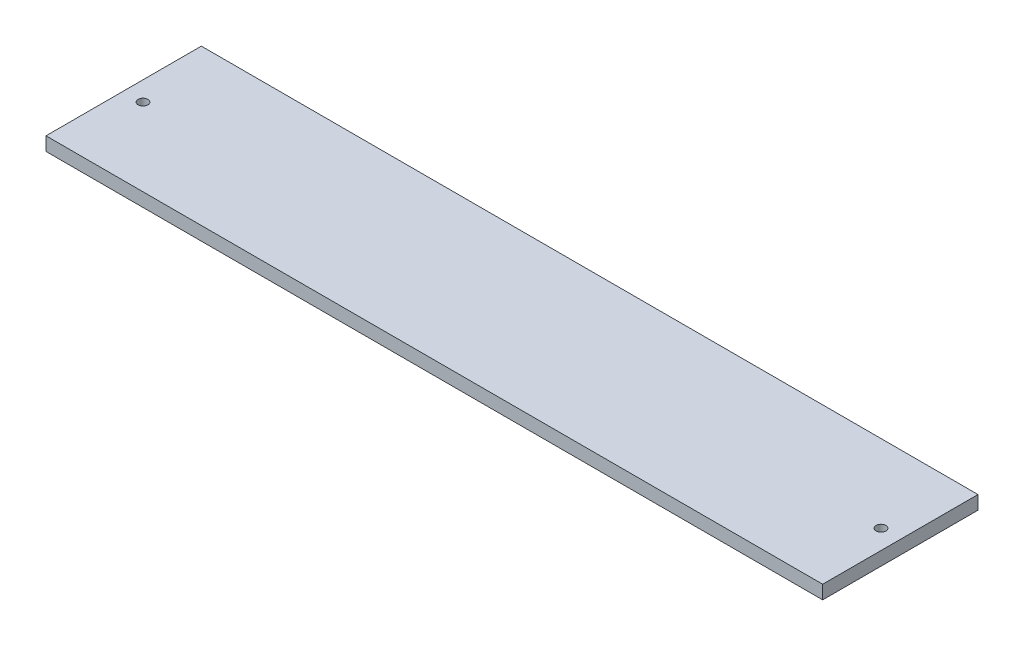
ISO-10303-21;
HEADER;
FILE_DESCRIPTION(('STEP AP214'),'2;1');
FILE_NAME('part.step','',(''),(''),'','','');
FILE_SCHEMA(('AUTOMOTIVE_DESIGN { 1 0 10303 214 1 1 1 1 }'));
ENDSEC;
DATA;
#1=APPLICATION_CONTEXT('core data for automotive mechanical design processes');
#2=APPLICATION_PROTOCOL_DEFINITION('international standard','automotive_design',2000,#1);
#3=PRODUCT_CONTEXT('',#1,'mechanical');
#4=PRODUCT('Part','Part','',(#3));
#5=PRODUCT_RELATED_PRODUCT_CATEGORY('part','',(#4));
#6=PRODUCT_DEFINITION_FORMATION('','',#4);
#7=PRODUCT_DEFINITION_CONTEXT('part definition',#1,'design');
#8=PRODUCT_DEFINITION('design','',#6,#7);
#9=PRODUCT_DEFINITION_SHAPE('','',#8);
#10=(LENGTH_UNIT() NAMED_UNIT(*) SI_UNIT(.MILLI.,.METRE.));
#11=(NAMED_UNIT(*) PLANE_ANGLE_UNIT() SI_UNIT($,.RADIAN.));
#12=(NAMED_UNIT(*) SI_UNIT($,.STERADIAN.) SOLID_ANGLE_UNIT());
#13=UNCERTAINTY_MEASURE_WITH_UNIT(LENGTH_MEASURE(1.E-05),#10,'distance_accuracy_value','');
#14=(GEOMETRIC_REPRESENTATION_CONTEXT(3) GLOBAL_UNCERTAINTY_ASSIGNED_CONTEXT((#13)) GLOBAL_UNIT_ASSIGNED_CONTEXT((#10,
#11,#12)) REPRESENTATION_CONTEXT('',''));
#15=CARTESIAN_POINT('',(0.,0.,0.));
#16=DIRECTION('',(0.,0.,1.));
#17=DIRECTION('',(1.,0.,0.));
#18=AXIS2_PLACEMENT_3D('',#15,#16,#17);
#19=CARTESIAN_POINT('',(0.,7.,0.));
#20=DIRECTION('',(1.,0.,0.));
#21=DIRECTION('',(0.,0.,-1.));
#22=AXIS2_PLACEMENT_3D('',#19,#20,#21);
#23=PLANE('',#22);
#24=DIRECTION('',(0.,0.,1.));
#25=VECTOR('',#24,1.);
#26=CARTESIAN_POINT('',(0.,0.,0.));
#27=LINE('',#26,#25);
#28=CARTESIAN_POINT('',(0.,0.,-80.));
#29=VERTEX_POINT('',#28);
#30=CARTESIAN_POINT('',(0.,0.,0.));
#31=VERTEX_POINT('',#30);
#32=EDGE_CURVE('E95',#29,#31,#27,.T.);
#33=ORIENTED_EDGE('',*,*,#32,.T.);
#34=DIRECTION('',(0.,-1.,0.));
#35=VECTOR('',#34,1.);
#36=CARTESIAN_POINT('',(0.,7.,0.));
#37=LINE('',#36,#35);
#38=CARTESIAN_POINT('',(0.,7.,0.));
#39=VERTEX_POINT('',#38);
#40=EDGE_CURVE('E11',#39,#31,#37,.T.);
#41=ORIENTED_EDGE('',*,*,#40,.F.);
#42=DIRECTION('',(0.,0.,1.));
#43=VECTOR('',#42,1.);
#44=CARTESIAN_POINT('',(0.,7.,0.));
#45=LINE('',#44,#43);
#46=CARTESIAN_POINT('',(0.,7.,-80.));
#47=VERTEX_POINT('',#46);
#48=EDGE_CURVE('E83',#47,#39,#45,.T.);
#49=ORIENTED_EDGE('',*,*,#48,.F.);
#50=DIRECTION('',(0.,-1.,0.));
#51=VECTOR('',#50,1.);
#52=CARTESIAN_POINT('',(0.,7.,-80.));
#53=LINE('',#52,#51);
#54=EDGE_CURVE('E91',#47,#29,#53,.T.);
#55=ORIENTED_EDGE('',*,*,#54,.T.);
#56=EDGE_LOOP('',(#33,#41,#49,#55));
#57=FACE_BOUND('',#56,.T.);
#58=ADVANCED_FACE('F32',(#57),#23,.F.);
#59=CARTESIAN_POINT('',(0.,7.,0.));
#60=DIRECTION('',(0.,0.,-1.));
#61=DIRECTION('',(-1.,0.,0.));
#62=AXIS2_PLACEMENT_3D('',#59,#60,#61);
#63=PLANE('',#62);
#64=DIRECTION('',(1.,0.,0.));
#65=VECTOR('',#64,1.);
#66=CARTESIAN_POINT('',(0.,0.,0.));
#67=LINE('',#66,#65);
#68=CARTESIAN_POINT('',(400.,0.,0.));
#69=VERTEX_POINT('',#68);
#70=EDGE_CURVE('E87',#31,#69,#67,.T.);
#71=ORIENTED_EDGE('',*,*,#70,.T.);
#72=DIRECTION('',(0.,-1.,0.));
#73=VECTOR('',#72,1.);
#74=CARTESIAN_POINT('',(400.,7.,0.));
#75=LINE('',#74,#73);
#76=CARTESIAN_POINT('',(400.,7.,0.));
#77=VERTEX_POINT('',#76);
#78=EDGE_CURVE('E40',#77,#69,#75,.T.);
#79=ORIENTED_EDGE('',*,*,#78,.F.);
#80=DIRECTION('',(1.,0.,0.));
#81=VECTOR('',#80,1.);
#82=CARTESIAN_POINT('',(0.,7.,0.));
#83=LINE('',#82,#81);
#84=EDGE_CURVE('E78',#39,#77,#83,.T.);
#85=ORIENTED_EDGE('',*,*,#84,.F.);
#86=ORIENTED_EDGE('',*,*,#40,.T.);
#87=EDGE_LOOP('',(#71,#79,#85,#86));
#88=FACE_BOUND('',#87,.T.);
#89=ADVANCED_FACE('F86',(#88),#63,.F.);
#90=CARTESIAN_POINT('',(400.,7.,0.));
#91=DIRECTION('',(-1.,0.,0.));
#92=DIRECTION('',(0.,0.,1.));
#93=AXIS2_PLACEMENT_3D('',#90,#91,#92);
#94=PLANE('',#93);
#95=DIRECTION('',(0.,0.,-1.));
#96=VECTOR('',#95,1.);
#97=CARTESIAN_POINT('',(400.,0.,0.));
#98=LINE('',#97,#96);
#99=CARTESIAN_POINT('',(400.,0.,-80.));
#100=VERTEX_POINT('',#99);
#101=EDGE_CURVE('E65',#69,#100,#98,.T.);
#102=ORIENTED_EDGE('',*,*,#101,.T.);
#103=DIRECTION('',(0.,-1.,0.));
#104=VECTOR('',#103,1.);
#105=CARTESIAN_POINT('',(400.,7.,-80.));
#106=LINE('',#105,#104);
#107=CARTESIAN_POINT('',(400.,7.,-80.));
#108=VERTEX_POINT('',#107);
#109=EDGE_CURVE('E88',#108,#100,#106,.T.);
#110=ORIENTED_EDGE('',*,*,#109,.F.);
#111=DIRECTION('',(0.,0.,-1.));
#112=VECTOR('',#111,1.);
#113=CARTESIAN_POINT('',(400.,7.,0.));
#114=LINE('',#113,#112);
#115=EDGE_CURVE('E81',#77,#108,#114,.T.);
#116=ORIENTED_EDGE('',*,*,#115,.F.);
#117=ORIENTED_EDGE('',*,*,#78,.T.);
#118=EDGE_LOOP('',(#102,#110,#116,#117));
#119=FACE_BOUND('',#118,.T.);
#120=ADVANCED_FACE('F89',(#119),#94,.F.);
#121=CARTESIAN_POINT('',(0.,7.,-80.));
#122=DIRECTION('',(0.,0.,1.));
#123=DIRECTION('',(1.,0.,0.));
#124=AXIS2_PLACEMENT_3D('',#121,#122,#123);
#125=PLANE('',#124);
#126=DIRECTION('',(-1.,0.,0.));
#127=VECTOR('',#126,1.);
#128=CARTESIAN_POINT('',(0.,0.,-80.));
#129=LINE('',#128,#127);
#130=EDGE_CURVE('E71',#100,#29,#129,.T.);
#131=ORIENTED_EDGE('',*,*,#130,.T.);
#132=ORIENTED_EDGE('',*,*,#54,.F.);
#133=DIRECTION('',(-1.,0.,0.));
#134=VECTOR('',#133,1.);
#135=CARTESIAN_POINT('',(0.,7.,-80.));
#136=LINE('',#135,#134);
#137=EDGE_CURVE('E48',#108,#47,#136,.T.);
#138=ORIENTED_EDGE('',*,*,#137,.F.);
#139=ORIENTED_EDGE('',*,*,#109,.T.);
#140=EDGE_LOOP('',(#131,#132,#138,#139));
#141=FACE_BOUND('',#140,.T.);
#142=ADVANCED_FACE('F103',(#141),#125,.F.);
#143=CARTESIAN_POINT('',(0.,7.,0.));
#144=DIRECTION('',(0.,-1.,0.));
#145=DIRECTION('',(0.,0.,-1.));
#146=AXIS2_PLACEMENT_3D('',#143,#144,#145);
#147=PLANE('',#146);
#148=CARTESIAN_POINT('',(9.95508986051211,7.,-39.9999999998883));
#149=DIRECTION('',(0.,-1.,0.));
#150=DIRECTION('',(0.,0.,-1.));
#151=AXIS2_PLACEMENT_3D('',#148,#149,#150);
#152=CIRCLE('',#151,2.50000000000002);
#153=CARTESIAN_POINT('',(9.95508986051211,7.,-42.4999999998883));
#154=VERTEX_POINT('',#153);
#155=EDGE_CURVE('E98',#154,#154,#152,.T.);
#156=ORIENTED_EDGE('',*,*,#155,.T.);
#157=EDGE_LOOP('',(#156));
#158=FACE_BOUND('',#157,.T.);
#159=CARTESIAN_POINT('',(390.044910139488,7.,-39.9999999998883));
#160=DIRECTION('',(0.,-1.,0.));
#161=DIRECTION('',(0.,0.,-1.));
#162=AXIS2_PLACEMENT_3D('',#159,#160,#161);
#163=CIRCLE('',#162,2.50000000000002);
#164=CARTESIAN_POINT('',(390.044910139488,7.,-42.4999999998883));
#165=VERTEX_POINT('',#164);
#166=EDGE_CURVE('E111',#165,#165,#163,.T.);
#167=ORIENTED_EDGE('',*,*,#166,.T.);
#168=EDGE_LOOP('',(#167));
#169=FACE_BOUND('',#168,.T.);
#170=ORIENTED_EDGE('',*,*,#48,.T.);
#171=ORIENTED_EDGE('',*,*,#84,.T.);
#172=ORIENTED_EDGE('',*,*,#115,.T.);
#173=ORIENTED_EDGE('',*,*,#137,.T.);
#174=EDGE_LOOP('',(#170,#171,#172,#173));
#175=FACE_BOUND('',#174,.T.);
#176=ADVANCED_FACE('F79',(#158,#169,#175),#147,.F.);
#177=CARTESIAN_POINT('',(0.,0.,0.));
#178=DIRECTION('',(0.,-1.,0.));
#179=DIRECTION('',(0.,0.,-1.));
#180=AXIS2_PLACEMENT_3D('',#177,#178,#179);
#181=PLANE('',#180);
#182=CARTESIAN_POINT('',(9.95508986051211,0.,-39.9999999998883));
#183=DIRECTION('',(0.,-1.,0.));
#184=DIRECTION('',(0.,0.,-1.));
#185=AXIS2_PLACEMENT_3D('',#182,#183,#184);
#186=CIRCLE('',#185,2.50000000000002);
#187=CARTESIAN_POINT('',(9.95508986051211,0.,-42.4999999998883));
#188=VERTEX_POINT('',#187);
#189=EDGE_CURVE('E114',#188,#188,#186,.T.);
#190=ORIENTED_EDGE('',*,*,#189,.F.);
#191=EDGE_LOOP('',(#190));
#192=FACE_BOUND('',#191,.T.);
#193=CARTESIAN_POINT('',(390.044910139488,0.,-39.9999999998883));
#194=DIRECTION('',(0.,-1.,0.));
#195=DIRECTION('',(0.,0.,1.));
#196=AXIS2_PLACEMENT_3D('',#193,#194,#195);
#197=CIRCLE('',#196,2.50000000000002);
#198=CARTESIAN_POINT('',(390.044910139488,0.,-37.4999999998883));
#199=VERTEX_POINT('',#198);
#200=EDGE_CURVE('E115',#199,#199,#197,.T.);
#201=ORIENTED_EDGE('',*,*,#200,.F.);
#202=EDGE_LOOP('',(#201));
#203=FACE_BOUND('',#202,.T.);
#204=ORIENTED_EDGE('',*,*,#32,.F.);
#205=ORIENTED_EDGE('',*,*,#130,.F.);
#206=ORIENTED_EDGE('',*,*,#101,.F.);
#207=ORIENTED_EDGE('',*,*,#70,.F.);
#208=EDGE_LOOP('',(#204,#205,#206,#207));
#209=FACE_BOUND('',#208,.T.);
#210=ADVANCED_FACE('F106',(#192,#203,#209),#181,.T.);
#211=CARTESIAN_POINT('',(390.044910139488,10.,-39.9999999998883));
#212=DIRECTION('',(0.,-1.,0.));
#213=DIRECTION('',(0.,0.,-1.));
#214=AXIS2_PLACEMENT_3D('',#211,#212,#213);
#215=CYLINDRICAL_SURFACE('',#214,2.50000000000002);
#216=ORIENTED_EDGE('',*,*,#200,.T.);
#217=EDGE_LOOP('',(#216));
#218=FACE_BOUND('',#217,.T.);
#219=ORIENTED_EDGE('',*,*,#166,.F.);
#220=EDGE_LOOP('',(#219));
#221=FACE_BOUND('',#220,.T.);
#222=ADVANCED_FACE('F126',(#218,#221),#215,.F.);
#223=CARTESIAN_POINT('',(9.95508986051211,10.,-39.9999999998883));
#224=DIRECTION('',(0.,-1.,0.));
#225=DIRECTION('',(0.,0.,-1.));
#226=AXIS2_PLACEMENT_3D('',#223,#224,#225);
#227=CYLINDRICAL_SURFACE('',#226,2.50000000000002);
#228=ORIENTED_EDGE('',*,*,#189,.T.);
#229=EDGE_LOOP('',(#228));
#230=FACE_BOUND('',#229,.T.);
#231=ORIENTED_EDGE('',*,*,#155,.F.);
#232=EDGE_LOOP('',(#231));
#233=FACE_BOUND('',#232,.T.);
#234=ADVANCED_FACE('F121',(#230,#233),#227,.F.);
#235=CLOSED_SHELL('',(#58,#89,#120,#142,#176,#210,#222,#234));
#236=MANIFOLD_SOLID_BREP('B2',#235);
#237=ADVANCED_BREP_SHAPE_REPRESENTATION('',(#18,#236),#14);
#238=SHAPE_DEFINITION_REPRESENTATION(#9,#237);
ENDSEC;
END-ISO-10303-21;
